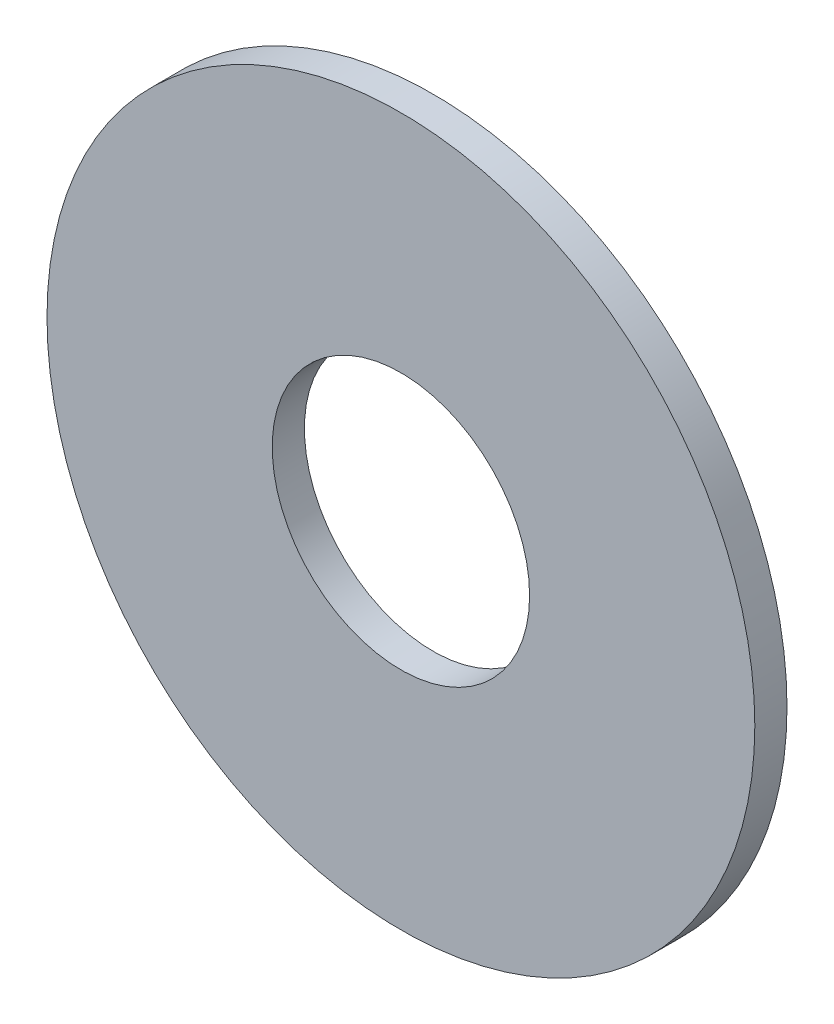
ISO-10303-21;
HEADER;
FILE_DESCRIPTION(('STEP AP214'),'2;1');
FILE_NAME('part.step','',(''),(''),'','','');
FILE_SCHEMA(('AUTOMOTIVE_DESIGN { 1 0 10303 214 1 1 1 1 }'));
ENDSEC;
DATA;
#1=APPLICATION_CONTEXT('core data for automotive mechanical design processes');
#2=APPLICATION_PROTOCOL_DEFINITION('international standard','automotive_design',2000,#1);
#3=PRODUCT_CONTEXT('',#1,'mechanical');
#4=PRODUCT('Part','Part','',(#3));
#5=PRODUCT_RELATED_PRODUCT_CATEGORY('part','',(#4));
#6=PRODUCT_DEFINITION_FORMATION('','',#4);
#7=PRODUCT_DEFINITION_CONTEXT('part definition',#1,'design');
#8=PRODUCT_DEFINITION('design','',#6,#7);
#9=PRODUCT_DEFINITION_SHAPE('','',#8);
#10=(LENGTH_UNIT() NAMED_UNIT(*) SI_UNIT(.MILLI.,.METRE.));
#11=(NAMED_UNIT(*) PLANE_ANGLE_UNIT() SI_UNIT($,.RADIAN.));
#12=(NAMED_UNIT(*) SI_UNIT($,.STERADIAN.) SOLID_ANGLE_UNIT());
#13=UNCERTAINTY_MEASURE_WITH_UNIT(LENGTH_MEASURE(1.E-05),#10,'distance_accuracy_value','');
#14=(GEOMETRIC_REPRESENTATION_CONTEXT(3) GLOBAL_UNCERTAINTY_ASSIGNED_CONTEXT((#13)) GLOBAL_UNIT_ASSIGNED_CONTEXT((#10,
#11,#12)) REPRESENTATION_CONTEXT('',''));
#15=CARTESIAN_POINT('',(0.,0.,0.));
#16=DIRECTION('',(0.,0.,1.));
#17=DIRECTION('',(1.,0.,0.));
#18=AXIS2_PLACEMENT_3D('',#15,#16,#17);
#19=CARTESIAN_POINT('',(0.,0.,0.5));
#20=DIRECTION('',(0.,0.,1.));
#21=DIRECTION('',(1.,0.,0.));
#22=AXIS2_PLACEMENT_3D('',#19,#20,#21);
#23=PLANE('',#22);
#24=CARTESIAN_POINT('',(0.,0.,0.5));
#25=DIRECTION('',(0.,0.,1.));
#26=DIRECTION('',(1.,0.,0.));
#27=AXIS2_PLACEMENT_3D('',#24,#25,#26);
#28=CIRCLE('',#27,5.5);
#29=CARTESIAN_POINT('',(5.5,0.,0.5));
#30=VERTEX_POINT('',#29);
#31=EDGE_CURVE('E10',#30,#30,#28,.T.);
#32=ORIENTED_EDGE('',*,*,#31,.T.);
#33=EDGE_LOOP('',(#32));
#34=FACE_BOUND('',#33,.T.);
#35=CARTESIAN_POINT('',(0.,0.,0.5));
#36=DIRECTION('',(0.,0.,1.));
#37=DIRECTION('',(1.,0.,0.));
#38=AXIS2_PLACEMENT_3D('',#35,#36,#37);
#39=CIRCLE('',#38,2.);
#40=CARTESIAN_POINT('',(2.,0.,0.5));
#41=VERTEX_POINT('',#40);
#42=EDGE_CURVE('E43',#41,#41,#39,.T.);
#43=ORIENTED_EDGE('',*,*,#42,.F.);
#44=EDGE_LOOP('',(#43));
#45=FACE_BOUND('',#44,.T.);
#46=ADVANCED_FACE('F32',(#34,#45),#23,.T.);
#47=CARTESIAN_POINT('',(0.,0.,0.));
#48=DIRECTION('',(0.,0.,1.));
#49=DIRECTION('',(1.,0.,0.));
#50=AXIS2_PLACEMENT_3D('',#47,#48,#49);
#51=PLANE('',#50);
#52=CARTESIAN_POINT('',(0.,0.,0.));
#53=DIRECTION('',(0.,0.,1.));
#54=DIRECTION('',(1.,0.,0.));
#55=AXIS2_PLACEMENT_3D('',#52,#53,#54);
#56=CIRCLE('',#55,5.5);
#57=CARTESIAN_POINT('',(5.5,0.,0.));
#58=VERTEX_POINT('',#57);
#59=EDGE_CURVE('E36',#58,#58,#56,.T.);
#60=ORIENTED_EDGE('',*,*,#59,.F.);
#61=EDGE_LOOP('',(#60));
#62=FACE_BOUND('',#61,.T.);
#63=CARTESIAN_POINT('',(0.,0.,0.));
#64=DIRECTION('',(0.,0.,1.));
#65=DIRECTION('',(1.,0.,0.));
#66=AXIS2_PLACEMENT_3D('',#63,#64,#65);
#67=CIRCLE('',#66,2.);
#68=CARTESIAN_POINT('',(2.,0.,0.));
#69=VERTEX_POINT('',#68);
#70=EDGE_CURVE('E45',#69,#69,#67,.T.);
#71=ORIENTED_EDGE('',*,*,#70,.T.);
#72=EDGE_LOOP('',(#71));
#73=FACE_BOUND('',#72,.T.);
#74=ADVANCED_FACE('F55',(#62,#73),#51,.F.);
#75=CARTESIAN_POINT('',(0.,0.,0.5));
#76=DIRECTION('',(0.,0.,-1.));
#77=DIRECTION('',(-1.,0.,0.));
#78=AXIS2_PLACEMENT_3D('',#75,#76,#77);
#79=CYLINDRICAL_SURFACE('',#78,5.5);
#80=ORIENTED_EDGE('',*,*,#31,.F.);
#81=EDGE_LOOP('',(#80));
#82=FACE_BOUND('',#81,.T.);
#83=ORIENTED_EDGE('',*,*,#59,.T.);
#84=EDGE_LOOP('',(#83));
#85=FACE_BOUND('',#84,.T.);
#86=ADVANCED_FACE('F34',(#82,#85),#79,.T.);
#87=CARTESIAN_POINT('',(0.,0.,0.5));
#88=DIRECTION('',(0.,0.,-1.));
#89=DIRECTION('',(-1.,0.,0.));
#90=AXIS2_PLACEMENT_3D('',#87,#88,#89);
#91=CYLINDRICAL_SURFACE('',#90,2.);
#92=ORIENTED_EDGE('',*,*,#42,.T.);
#93=EDGE_LOOP('',(#92));
#94=FACE_BOUND('',#93,.T.);
#95=ORIENTED_EDGE('',*,*,#70,.F.);
#96=EDGE_LOOP('',(#95));
#97=FACE_BOUND('',#96,.T.);
#98=ADVANCED_FACE('F51',(#94,#97),#91,.F.);
#99=CLOSED_SHELL('',(#46,#74,#86,#98));
#100=MANIFOLD_SOLID_BREP('B2',#99);
#101=ADVANCED_BREP_SHAPE_REPRESENTATION('',(#18,#100),#14);
#102=SHAPE_DEFINITION_REPRESENTATION(#9,#101);
ENDSEC;
END-ISO-10303-21;
